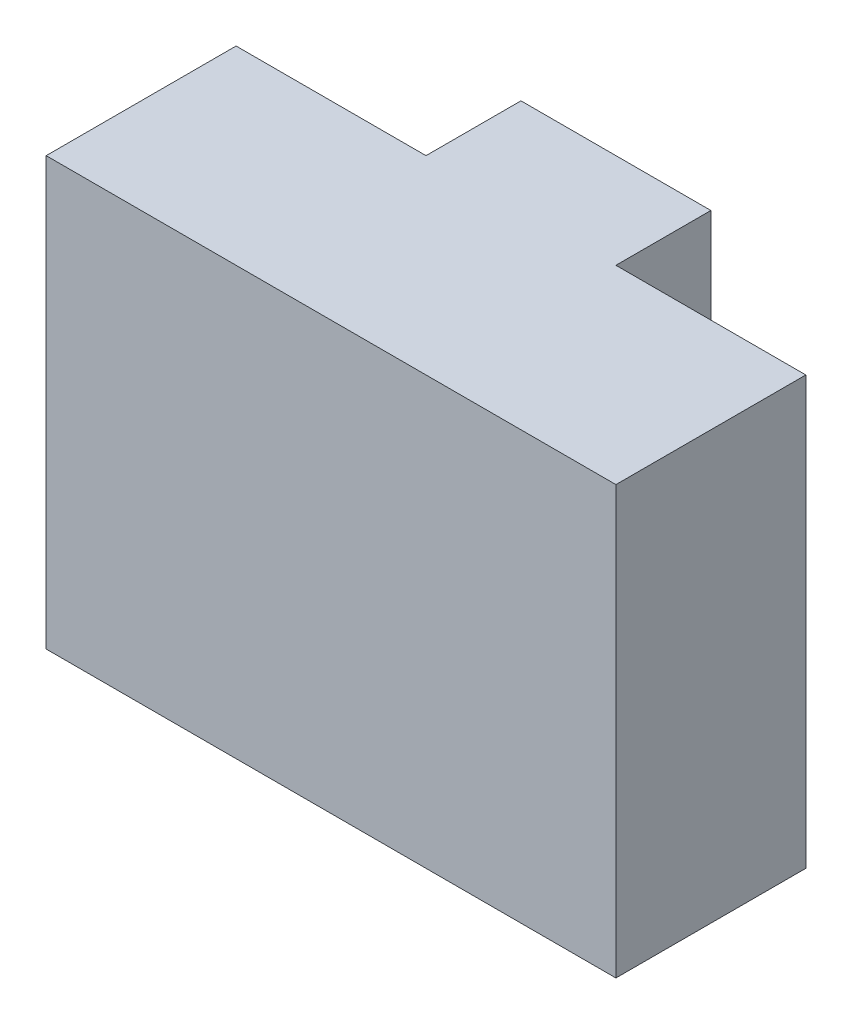
ISO-10303-21;
HEADER;
FILE_DESCRIPTION(('STEP AP214'),'2;1');
FILE_NAME('part.step','',(''),(''),'','','');
FILE_SCHEMA(('AUTOMOTIVE_DESIGN { 1 0 10303 214 1 1 1 1 }'));
ENDSEC;
DATA;
#1=APPLICATION_CONTEXT('core data for automotive mechanical design processes');
#2=APPLICATION_PROTOCOL_DEFINITION('international standard','automotive_design',2000,#1);
#3=PRODUCT_CONTEXT('',#1,'mechanical');
#4=PRODUCT('Part','Part','',(#3));
#5=PRODUCT_RELATED_PRODUCT_CATEGORY('part','',(#4));
#6=PRODUCT_DEFINITION_FORMATION('','',#4);
#7=PRODUCT_DEFINITION_CONTEXT('part definition',#1,'design');
#8=PRODUCT_DEFINITION('design','',#6,#7);
#9=PRODUCT_DEFINITION_SHAPE('','',#8);
#10=(LENGTH_UNIT() NAMED_UNIT(*) SI_UNIT(.MILLI.,.METRE.));
#11=(NAMED_UNIT(*) PLANE_ANGLE_UNIT() SI_UNIT($,.RADIAN.));
#12=(NAMED_UNIT(*) SI_UNIT($,.STERADIAN.) SOLID_ANGLE_UNIT());
#13=UNCERTAINTY_MEASURE_WITH_UNIT(LENGTH_MEASURE(1.E-05),#10,'distance_accuracy_value','');
#14=(GEOMETRIC_REPRESENTATION_CONTEXT(3) GLOBAL_UNCERTAINTY_ASSIGNED_CONTEXT((#13)) GLOBAL_UNIT_ASSIGNED_CONTEXT((#10,
#11,#12)) REPRESENTATION_CONTEXT('',''));
#15=CARTESIAN_POINT('',(0.,0.,0.));
#16=DIRECTION('',(0.,0.,1.));
#17=DIRECTION('',(1.,0.,0.));
#18=AXIS2_PLACEMENT_3D('',#15,#16,#17);
#19=CARTESIAN_POINT('',(-30.,45.,-20.));
#20=DIRECTION('',(1.,0.,0.));
#21=DIRECTION('',(0.,0.,-1.));
#22=AXIS2_PLACEMENT_3D('',#19,#20,#21);
#23=PLANE('',#22);
#24=DIRECTION('',(0.,0.,1.));
#25=VECTOR('',#24,1.);
#26=CARTESIAN_POINT('',(-30.,0.,-20.));
#27=LINE('',#26,#25);
#28=CARTESIAN_POINT('',(-30.,0.,-20.));
#29=VERTEX_POINT('',#28);
#30=CARTESIAN_POINT('',(-30.,0.,0.));
#31=VERTEX_POINT('',#30);
#32=EDGE_CURVE('E144',#29,#31,#27,.T.);
#33=ORIENTED_EDGE('',*,*,#32,.T.);
#34=DIRECTION('',(0.,-1.,0.));
#35=VECTOR('',#34,1.);
#36=CARTESIAN_POINT('',(-30.,45.,0.));
#37=LINE('',#36,#35);
#38=CARTESIAN_POINT('',(-30.,45.,0.));
#39=VERTEX_POINT('',#38);
#40=EDGE_CURVE('E11',#39,#31,#37,.T.);
#41=ORIENTED_EDGE('',*,*,#40,.F.);
#42=DIRECTION('',(0.,0.,1.));
#43=VECTOR('',#42,1.);
#44=CARTESIAN_POINT('',(-30.,45.,-20.));
#45=LINE('',#44,#43);
#46=CARTESIAN_POINT('',(-30.,45.,-20.));
#47=VERTEX_POINT('',#46);
#48=EDGE_CURVE('E166',#47,#39,#45,.T.);
#49=ORIENTED_EDGE('',*,*,#48,.F.);
#50=DIRECTION('',(0.,-1.,0.));
#51=VECTOR('',#50,1.);
#52=CARTESIAN_POINT('',(-30.,45.,-20.));
#53=LINE('',#52,#51);
#54=EDGE_CURVE('E140',#47,#29,#53,.T.);
#55=ORIENTED_EDGE('',*,*,#54,.T.);
#56=EDGE_LOOP('',(#33,#41,#49,#55));
#57=FACE_BOUND('',#56,.T.);
#58=ADVANCED_FACE('F42',(#57),#23,.F.);
#59=CARTESIAN_POINT('',(-30.,45.,0.));
#60=DIRECTION('',(0.,0.,-1.));
#61=DIRECTION('',(-1.,0.,0.));
#62=AXIS2_PLACEMENT_3D('',#59,#60,#61);
#63=PLANE('',#62);
#64=DIRECTION('',(1.,0.,0.));
#65=VECTOR('',#64,1.);
#66=CARTESIAN_POINT('',(-30.,0.,0.));
#67=LINE('',#66,#65);
#68=CARTESIAN_POINT('',(30.,0.,0.));
#69=VERTEX_POINT('',#68);
#70=EDGE_CURVE('E148',#31,#69,#67,.T.);
#71=ORIENTED_EDGE('',*,*,#70,.T.);
#72=DIRECTION('',(0.,-1.,0.));
#73=VECTOR('',#72,1.);
#74=CARTESIAN_POINT('',(30.,45.,0.));
#75=LINE('',#74,#73);
#76=CARTESIAN_POINT('',(30.,45.,0.));
#77=VERTEX_POINT('',#76);
#78=EDGE_CURVE('E51',#77,#69,#75,.T.);
#79=ORIENTED_EDGE('',*,*,#78,.F.);
#80=DIRECTION('',(1.,0.,0.));
#81=VECTOR('',#80,1.);
#82=CARTESIAN_POINT('',(-30.,45.,0.));
#83=LINE('',#82,#81);
#84=EDGE_CURVE('E102',#39,#77,#83,.T.);
#85=ORIENTED_EDGE('',*,*,#84,.F.);
#86=ORIENTED_EDGE('',*,*,#40,.T.);
#87=EDGE_LOOP('',(#71,#79,#85,#86));
#88=FACE_BOUND('',#87,.T.);
#89=ADVANCED_FACE('F215',(#88),#63,.F.);
#90=CARTESIAN_POINT('',(30.,45.,0.));
#91=DIRECTION('',(-1.,0.,0.));
#92=DIRECTION('',(0.,0.,1.));
#93=AXIS2_PLACEMENT_3D('',#90,#91,#92);
#94=PLANE('',#93);
#95=DIRECTION('',(0.,0.,-1.));
#96=VECTOR('',#95,1.);
#97=CARTESIAN_POINT('',(30.,0.,0.));
#98=LINE('',#97,#96);
#99=CARTESIAN_POINT('',(30.,0.,-20.));
#100=VERTEX_POINT('',#99);
#101=EDGE_CURVE('E151',#69,#100,#98,.T.);
#102=ORIENTED_EDGE('',*,*,#101,.T.);
#103=DIRECTION('',(0.,-1.,0.));
#104=VECTOR('',#103,1.);
#105=CARTESIAN_POINT('',(30.,45.,-20.));
#106=LINE('',#105,#104);
#107=CARTESIAN_POINT('',(30.,45.,-20.));
#108=VERTEX_POINT('',#107);
#109=EDGE_CURVE('E177',#108,#100,#106,.T.);
#110=ORIENTED_EDGE('',*,*,#109,.F.);
#111=DIRECTION('',(0.,0.,-1.));
#112=VECTOR('',#111,1.);
#113=CARTESIAN_POINT('',(30.,45.,0.));
#114=LINE('',#113,#112);
#115=EDGE_CURVE('E188',#77,#108,#114,.T.);
#116=ORIENTED_EDGE('',*,*,#115,.F.);
#117=ORIENTED_EDGE('',*,*,#78,.T.);
#118=EDGE_LOOP('',(#102,#110,#116,#117));
#119=FACE_BOUND('',#118,.T.);
#120=ADVANCED_FACE('F186',(#119),#94,.F.);
#121=CARTESIAN_POINT('',(30.,45.,-20.));
#122=DIRECTION('',(0.,0.,1.));
#123=DIRECTION('',(1.,0.,0.));
#124=AXIS2_PLACEMENT_3D('',#121,#122,#123);
#125=PLANE('',#124);
#126=DIRECTION('',(-1.,0.,0.));
#127=VECTOR('',#126,1.);
#128=CARTESIAN_POINT('',(30.,0.,-20.));
#129=LINE('',#128,#127);
#130=CARTESIAN_POINT('',(10.,0.,-20.));
#131=VERTEX_POINT('',#130);
#132=EDGE_CURVE('E154',#100,#131,#129,.T.);
#133=ORIENTED_EDGE('',*,*,#132,.T.);
#134=DIRECTION('',(0.,-1.,0.));
#135=VECTOR('',#134,1.);
#136=CARTESIAN_POINT('',(10.,45.,-20.));
#137=LINE('',#136,#135);
#138=CARTESIAN_POINT('',(10.,45.,-20.));
#139=VERTEX_POINT('',#138);
#140=EDGE_CURVE('E173',#139,#131,#137,.T.);
#141=ORIENTED_EDGE('',*,*,#140,.F.);
#142=DIRECTION('',(-1.,0.,0.));
#143=VECTOR('',#142,1.);
#144=CARTESIAN_POINT('',(30.,45.,-20.));
#145=LINE('',#144,#143);
#146=EDGE_CURVE('E201',#108,#139,#145,.T.);
#147=ORIENTED_EDGE('',*,*,#146,.F.);
#148=ORIENTED_EDGE('',*,*,#109,.T.);
#149=EDGE_LOOP('',(#133,#141,#147,#148));
#150=FACE_BOUND('',#149,.T.);
#151=ADVANCED_FACE('F196',(#150),#125,.F.);
#152=CARTESIAN_POINT('',(10.,45.,-20.));
#153=DIRECTION('',(-1.,0.,0.));
#154=DIRECTION('',(0.,0.,1.));
#155=AXIS2_PLACEMENT_3D('',#152,#153,#154);
#156=PLANE('',#155);
#157=DIRECTION('',(0.,0.,-1.));
#158=VECTOR('',#157,1.);
#159=CARTESIAN_POINT('',(10.,0.,-20.));
#160=LINE('',#159,#158);
#161=CARTESIAN_POINT('',(10.,0.,-30.));
#162=VERTEX_POINT('',#161);
#163=EDGE_CURVE('E157',#131,#162,#160,.T.);
#164=ORIENTED_EDGE('',*,*,#163,.T.);
#165=DIRECTION('',(0.,-1.,0.));
#166=VECTOR('',#165,1.);
#167=CARTESIAN_POINT('',(10.,45.,-30.));
#168=LINE('',#167,#166);
#169=CARTESIAN_POINT('',(10.,45.,-30.));
#170=VERTEX_POINT('',#169);
#171=EDGE_CURVE('E132',#170,#162,#168,.T.);
#172=ORIENTED_EDGE('',*,*,#171,.F.);
#173=DIRECTION('',(0.,0.,-1.));
#174=VECTOR('',#173,1.);
#175=CARTESIAN_POINT('',(10.,45.,-20.));
#176=LINE('',#175,#174);
#177=EDGE_CURVE('E121',#139,#170,#176,.T.);
#178=ORIENTED_EDGE('',*,*,#177,.F.);
#179=ORIENTED_EDGE('',*,*,#140,.T.);
#180=EDGE_LOOP('',(#164,#172,#178,#179));
#181=FACE_BOUND('',#180,.T.);
#182=ADVANCED_FACE('F199',(#181),#156,.F.);
#183=CARTESIAN_POINT('',(10.,45.,-30.));
#184=DIRECTION('',(0.,0.,1.));
#185=DIRECTION('',(1.,0.,0.));
#186=AXIS2_PLACEMENT_3D('',#183,#184,#185);
#187=PLANE('',#186);
#188=DIRECTION('',(-1.,0.,0.));
#189=VECTOR('',#188,1.);
#190=CARTESIAN_POINT('',(10.,0.,-30.));
#191=LINE('',#190,#189);
#192=CARTESIAN_POINT('',(-10.,0.,-30.));
#193=VERTEX_POINT('',#192);
#194=EDGE_CURVE('E130',#162,#193,#191,.T.);
#195=ORIENTED_EDGE('',*,*,#194,.T.);
#196=DIRECTION('',(0.,-1.,0.));
#197=VECTOR('',#196,1.);
#198=CARTESIAN_POINT('',(-10.,45.,-30.));
#199=LINE('',#198,#197);
#200=CARTESIAN_POINT('',(-10.,45.,-30.));
#201=VERTEX_POINT('',#200);
#202=EDGE_CURVE('E127',#201,#193,#199,.T.);
#203=ORIENTED_EDGE('',*,*,#202,.F.);
#204=DIRECTION('',(-1.,0.,0.));
#205=VECTOR('',#204,1.);
#206=CARTESIAN_POINT('',(10.,45.,-30.));
#207=LINE('',#206,#205);
#208=EDGE_CURVE('E115',#170,#201,#207,.T.);
#209=ORIENTED_EDGE('',*,*,#208,.F.);
#210=ORIENTED_EDGE('',*,*,#171,.T.);
#211=EDGE_LOOP('',(#195,#203,#209,#210));
#212=FACE_BOUND('',#211,.T.);
#213=ADVANCED_FACE('F128',(#212),#187,.F.);
#214=CARTESIAN_POINT('',(-10.,45.,-30.));
#215=DIRECTION('',(1.,0.,0.));
#216=DIRECTION('',(0.,0.,-1.));
#217=AXIS2_PLACEMENT_3D('',#214,#215,#216);
#218=PLANE('',#217);
#219=DIRECTION('',(0.,0.,1.));
#220=VECTOR('',#219,1.);
#221=CARTESIAN_POINT('',(-10.,0.,-30.));
#222=LINE('',#221,#220);
#223=CARTESIAN_POINT('',(-10.,0.,-20.));
#224=VERTEX_POINT('',#223);
#225=EDGE_CURVE('E88',#193,#224,#222,.T.);
#226=ORIENTED_EDGE('',*,*,#225,.T.);
#227=DIRECTION('',(0.,-1.,0.));
#228=VECTOR('',#227,1.);
#229=CARTESIAN_POINT('',(-10.,45.,-20.));
#230=LINE('',#229,#228);
#231=CARTESIAN_POINT('',(-10.,45.,-20.));
#232=VERTEX_POINT('',#231);
#233=EDGE_CURVE('E133',#232,#224,#230,.T.);
#234=ORIENTED_EDGE('',*,*,#233,.F.);
#235=DIRECTION('',(0.,0.,1.));
#236=VECTOR('',#235,1.);
#237=CARTESIAN_POINT('',(-10.,45.,-30.));
#238=LINE('',#237,#236);
#239=EDGE_CURVE('E119',#201,#232,#238,.T.);
#240=ORIENTED_EDGE('',*,*,#239,.F.);
#241=ORIENTED_EDGE('',*,*,#202,.T.);
#242=EDGE_LOOP('',(#226,#234,#240,#241));
#243=FACE_BOUND('',#242,.T.);
#244=ADVANCED_FACE('F135',(#243),#218,.F.);
#245=CARTESIAN_POINT('',(-10.,45.,-20.));
#246=DIRECTION('',(0.,0.,1.));
#247=DIRECTION('',(1.,0.,0.));
#248=AXIS2_PLACEMENT_3D('',#245,#246,#247);
#249=PLANE('',#248);
#250=DIRECTION('',(-1.,0.,0.));
#251=VECTOR('',#250,1.);
#252=CARTESIAN_POINT('',(-10.,0.,-20.));
#253=LINE('',#252,#251);
#254=EDGE_CURVE('E94',#224,#29,#253,.T.);
#255=ORIENTED_EDGE('',*,*,#254,.T.);
#256=ORIENTED_EDGE('',*,*,#54,.F.);
#257=DIRECTION('',(-1.,0.,0.));
#258=VECTOR('',#257,1.);
#259=CARTESIAN_POINT('',(-10.,45.,-20.));
#260=LINE('',#259,#258);
#261=EDGE_CURVE('E59',#232,#47,#260,.T.);
#262=ORIENTED_EDGE('',*,*,#261,.F.);
#263=ORIENTED_EDGE('',*,*,#233,.T.);
#264=EDGE_LOOP('',(#255,#256,#262,#263));
#265=FACE_BOUND('',#264,.T.);
#266=ADVANCED_FACE('F231',(#265),#249,.F.);
#267=CARTESIAN_POINT('',(0.,45.,0.));
#268=DIRECTION('',(0.,1.,0.));
#269=DIRECTION('',(0.,0.,1.));
#270=AXIS2_PLACEMENT_3D('',#267,#268,#269);
#271=PLANE('',#270);
#272=ORIENTED_EDGE('',*,*,#48,.T.);
#273=ORIENTED_EDGE('',*,*,#84,.T.);
#274=ORIENTED_EDGE('',*,*,#115,.T.);
#275=ORIENTED_EDGE('',*,*,#146,.T.);
#276=ORIENTED_EDGE('',*,*,#177,.T.);
#277=ORIENTED_EDGE('',*,*,#208,.T.);
#278=ORIENTED_EDGE('',*,*,#239,.T.);
#279=ORIENTED_EDGE('',*,*,#261,.T.);
#280=EDGE_LOOP('',(#272,#273,#274,#275,#276,#277,#278,#279));
#281=FACE_BOUND('',#280,.T.);
#282=ADVANCED_FACE('F117',(#281),#271,.T.);
#283=CARTESIAN_POINT('',(0.,0.,0.));
#284=DIRECTION('',(0.,1.,0.));
#285=DIRECTION('',(0.,0.,1.));
#286=AXIS2_PLACEMENT_3D('',#283,#284,#285);
#287=PLANE('',#286);
#288=ORIENTED_EDGE('',*,*,#32,.F.);
#289=ORIENTED_EDGE('',*,*,#254,.F.);
#290=ORIENTED_EDGE('',*,*,#225,.F.);
#291=ORIENTED_EDGE('',*,*,#194,.F.);
#292=ORIENTED_EDGE('',*,*,#163,.F.);
#293=ORIENTED_EDGE('',*,*,#132,.F.);
#294=ORIENTED_EDGE('',*,*,#101,.F.);
#295=ORIENTED_EDGE('',*,*,#70,.F.);
#296=EDGE_LOOP('',(#288,#289,#290,#291,#292,#293,#294,#295));
#297=FACE_BOUND('',#296,.T.);
#298=ADVANCED_FACE('F192',(#297),#287,.F.);
#299=CLOSED_SHELL('',(#58,#89,#120,#151,#182,#213,#244,#266,#282,#298));
#300=MANIFOLD_SOLID_BREP('B2',#299);
#301=ADVANCED_BREP_SHAPE_REPRESENTATION('',(#18,#300),#14);
#302=SHAPE_DEFINITION_REPRESENTATION(#9,#301);
ENDSEC;
END-ISO-10303-21;
